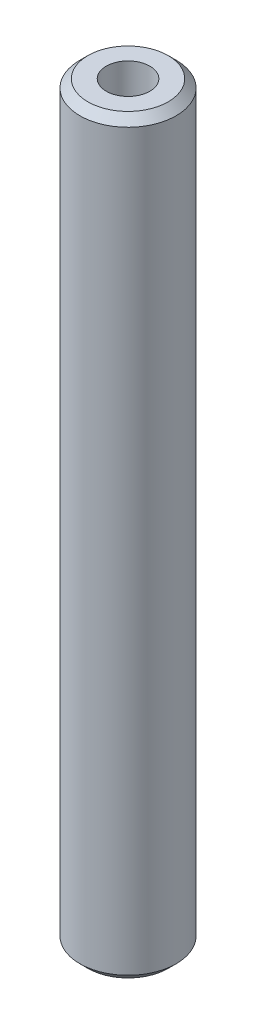
ISO-10303-21;
HEADER;
FILE_DESCRIPTION(('STEP AP214'),'2;1');
FILE_NAME('part.step','',(''),(''),'','','');
FILE_SCHEMA(('AUTOMOTIVE_DESIGN { 1 0 10303 214 1 1 1 1 }'));
ENDSEC;
DATA;
#1=APPLICATION_CONTEXT('core data for automotive mechanical design processes');
#2=APPLICATION_PROTOCOL_DEFINITION('international standard','automotive_design',2000,#1);
#3=PRODUCT_CONTEXT('',#1,'mechanical');
#4=PRODUCT('Part','Part','',(#3));
#5=PRODUCT_RELATED_PRODUCT_CATEGORY('part','',(#4));
#6=PRODUCT_DEFINITION_FORMATION('','',#4);
#7=PRODUCT_DEFINITION_CONTEXT('part definition',#1,'design');
#8=PRODUCT_DEFINITION('design','',#6,#7);
#9=PRODUCT_DEFINITION_SHAPE('','',#8);
#10=(LENGTH_UNIT() NAMED_UNIT(*) SI_UNIT(.MILLI.,.METRE.));
#11=(NAMED_UNIT(*) PLANE_ANGLE_UNIT() SI_UNIT($,.RADIAN.));
#12=(NAMED_UNIT(*) SI_UNIT($,.STERADIAN.) SOLID_ANGLE_UNIT());
#13=UNCERTAINTY_MEASURE_WITH_UNIT(LENGTH_MEASURE(1.E-05),#10,'distance_accuracy_value','');
#14=(GEOMETRIC_REPRESENTATION_CONTEXT(3) GLOBAL_UNCERTAINTY_ASSIGNED_CONTEXT((#13)) GLOBAL_UNIT_ASSIGNED_CONTEXT((#10,
#11,#12)) REPRESENTATION_CONTEXT('',''));
#15=CARTESIAN_POINT('',(0.,0.,0.));
#16=DIRECTION('',(0.,0.,1.));
#17=DIRECTION('',(1.,0.,0.));
#18=AXIS2_PLACEMENT_3D('',#15,#16,#17);
#19=CARTESIAN_POINT('',(0.,428.601661325985,0.));
#20=DIRECTION('',(0.,-1.,0.));
#21=DIRECTION('',(0.,0.,-1.));
#22=AXIS2_PLACEMENT_3D('',#19,#20,#21);
#23=CYLINDRICAL_SURFACE('',#22,27.5);
#24=CARTESIAN_POINT('',(0.,424.009006591973,0.));
#25=DIRECTION('',(0.,1.,0.));
#26=DIRECTION('',(0.,0.,1.));
#27=AXIS2_PLACEMENT_3D('',#24,#25,#26);
#28=CIRCLE('',#27,27.5);
#29=CARTESIAN_POINT('',(0.,424.009006591973,-27.5));
#30=VERTEX_POINT('',#29);
#31=EDGE_CURVE('E50',#30,#30,#28,.F.);
#32=CARTESIAN_POINT('',(0.,4.59265473401199,0.));
#33=DIRECTION('',(0.,1.,0.));
#34=DIRECTION('',(0.,0.,1.));
#35=AXIS2_PLACEMENT_3D('',#32,#33,#34);
#36=CIRCLE('',#35,27.5);
#37=CARTESIAN_POINT('',(0.,4.59265473401194,-27.5));
#38=VERTEX_POINT('',#37);
#39=EDGE_CURVE('E51',#38,#38,#36,.T.);
#40=CARTESIAN_POINT('',(0.,424.009006591973,-27.5));
#41=CARTESIAN_POINT('',(0.,419.64008626012,-27.5));
#42=CARTESIAN_POINT('',(0.,415.271165928266,-27.5));
#43=CARTESIAN_POINT('',(0.,406.533325264558,-27.5));
#44=CARTESIAN_POINT('',(0.,402.164404932705,-27.5));
#45=CARTESIAN_POINT('',(0.,393.426564268997,-27.5));
#46=CARTESIAN_POINT('',(0.,389.057643937143,-27.5));
#47=CARTESIAN_POINT('',(0.,380.319803273436,-27.5));
#48=CARTESIAN_POINT('',(0.,375.950882941582,-27.5));
#49=CARTESIAN_POINT('',(0.,367.213042277874,-27.5));
#50=CARTESIAN_POINT('',(0.,362.844121946021,-27.5));
#51=CARTESIAN_POINT('',(0.,354.106281282313,-27.5));
#52=CARTESIAN_POINT('',(0.,349.737360950459,-27.5));
#53=CARTESIAN_POINT('',(0.,340.999520286752,-27.5));
#54=CARTESIAN_POINT('',(0.,336.630599954898,-27.5));
#55=CARTESIAN_POINT('',(0.,327.892759291191,-27.5));
#56=CARTESIAN_POINT('',(0.,323.523838959337,-27.5));
#57=CARTESIAN_POINT('',(0.,314.785998295629,-27.5));
#58=CARTESIAN_POINT('',(0.,310.417077963776,-27.5));
#59=CARTESIAN_POINT('',(0.,301.679237300068,-27.5));
#60=CARTESIAN_POINT('',(0.,297.310316968214,-27.5));
#61=CARTESIAN_POINT('',(0.,288.572476304507,-27.5));
#62=CARTESIAN_POINT('',(0.,284.203555972653,-27.5));
#63=CARTESIAN_POINT('',(0.,275.465715308945,-27.5));
#64=CARTESIAN_POINT('',(0.,271.096794977092,-27.5));
#65=CARTESIAN_POINT('',(0.,262.358954313384,-27.5));
#66=CARTESIAN_POINT('',(0.,257.99003398153,-27.5));
#67=CARTESIAN_POINT('',(0.,249.252193317823,-27.5));
#68=CARTESIAN_POINT('',(0.,244.883272985969,-27.5));
#69=CARTESIAN_POINT('',(0.,236.145432322261,-27.5));
#70=CARTESIAN_POINT('',(0.,231.776511990408,-27.5));
#71=CARTESIAN_POINT('',(0.,223.0386713267,-27.5));
#72=CARTESIAN_POINT('',(0.,218.669750994846,-27.5));
#73=CARTESIAN_POINT('',(0.,209.931910331139,-27.5));
#74=CARTESIAN_POINT('',(0.,205.562989999285,-27.5));
#75=CARTESIAN_POINT('',(0.,196.825149335578,-27.5));
#76=CARTESIAN_POINT('',(0.,192.456229003724,-27.5));
#77=CARTESIAN_POINT('',(0.,183.718388340016,-27.5));
#78=CARTESIAN_POINT('',(0.,179.349468008163,-27.5));
#79=CARTESIAN_POINT('',(0.,170.611627344455,-27.5));
#80=CARTESIAN_POINT('',(0.,166.242707012601,-27.5));
#81=CARTESIAN_POINT('',(0.,157.504866348894,-27.5));
#82=CARTESIAN_POINT('',(0.,153.13594601704,-27.5));
#83=CARTESIAN_POINT('',(0.,144.398105353332,-27.5));
#84=CARTESIAN_POINT('',(0.,140.029185021479,-27.5));
#85=CARTESIAN_POINT('',(0.,131.291344357771,-27.5));
#86=CARTESIAN_POINT('',(0.,126.922424025917,-27.5));
#87=CARTESIAN_POINT('',(0.,118.18458336221,-27.5));
#88=CARTESIAN_POINT('',(0.,113.815663030356,-27.5));
#89=CARTESIAN_POINT('',(0.,105.077822366649,-27.5));
#90=CARTESIAN_POINT('',(0.,100.708902034795,-27.5));
#91=CARTESIAN_POINT('',(0.,91.9710613710872,-27.5));
#92=CARTESIAN_POINT('',(0.,87.6021410392335,-27.5));
#93=CARTESIAN_POINT('',(0.,78.8643003755259,-27.5));
#94=CARTESIAN_POINT('',(0.,74.4953800436722,-27.5));
#95=CARTESIAN_POINT('',(0.,65.7575393799646,-27.5));
#96=CARTESIAN_POINT('',(0.,61.3886190481109,-27.5));
#97=CARTESIAN_POINT('',(0.,52.6507783844034,-27.5));
#98=CARTESIAN_POINT('',(0.,48.2818580525496,-27.5));
#99=CARTESIAN_POINT('',(0.,39.5440173888421,-27.5));
#100=CARTESIAN_POINT('',(0.,35.1750970569883,-27.5));
#101=CARTESIAN_POINT('',(0.,26.4372563932808,-27.5));
#102=CARTESIAN_POINT('',(0.,22.068336061427,-27.5));
#103=CARTESIAN_POINT('',(0.,13.3304953977195,-27.5));
#104=CARTESIAN_POINT('',(0.,8.9615750658657,-27.5));
#105=CARTESIAN_POINT('',(0.,4.59265473401194,-27.5));
#106=B_SPLINE_CURVE_WITH_KNOTS('',3,(#40,#41,#42,#43,#44,#45,#46,#47,#48,#49,#50,#51,#52,#53,
#54,#55,#56,#57,#58,#59,#60,#61,#62,#63,#64,#65,#66,#67,#68,#69,#70,#71,#72,#73,#74,#75,#76,#77,
#78,#79,#80,#81,#82,#83,#84,#85,#86,#87,#88,#89,#90,#91,#92,#93,#94,#95,#96,#97,#98,#99,#100,
#101,#102,#103,#104,#105),.UNSPECIFIED.,.F.,.F.,(4,2,2,2,2,2,2,2,2,2,2,2,2,2,2,2,2,2,2,2,2,2,2,
2,2,2,2,2,2,2,2,2,4),(0.,13.1067609955614,26.2135219911226,39.3202829866839,52.4270439822452,
65.5338049778065,78.6405659733678,91.7473269689291,104.85408796449,117.960848960052,
131.067609955613,144.174370951174,157.281131946736,170.387892942297,183.494653937858,
196.601414933419,209.708175928981,222.814936924542,235.921697920103,249.028458915665,
262.135219911226,275.241980906787,288.348741902349,301.45550289791,314.562263893471,
327.669024889032,340.775785884594,353.882546880155,366.989307875716,380.096068871278,
393.202829866839,406.3095908624,419.416351857962),.UNSPECIFIED.);
#107=EDGE_CURVE('BSEAM39',#30,#38,#106,.T.);
#108=ORIENTED_EDGE('',*,*,#31,.T.);
#109=ORIENTED_EDGE('',*,*,#39,.T.);
#110=ORIENTED_EDGE('',*,*,#107,.T.);
#111=ORIENTED_EDGE('',*,*,#107,.F.);
#112=EDGE_LOOP('',(#108,#110,#109,#111));
#113=FACE_BOUND('',#112,.T.);
#114=ADVANCED_FACE('F39',(#113),#23,.T.);
#115=CARTESIAN_POINT('',(0.,428.601661325985,0.));
#116=DIRECTION('',(0.,1.,0.));
#117=DIRECTION('',(0.,0.,1.));
#118=AXIS2_PLACEMENT_3D('',#115,#116,#117);
#119=PLANE('',#118);
#120=CARTESIAN_POINT('',(0.,428.601661325985,0.));
#121=DIRECTION('',(0.,1.,0.));
#122=DIRECTION('',(0.,0.,1.));
#123=AXIS2_PLACEMENT_3D('',#120,#121,#122);
#124=CIRCLE('',#123,22.9073452659884);
#125=CARTESIAN_POINT('',(0.,428.601661325985,22.9073452659884));
#126=VERTEX_POINT('',#125);
#127=EDGE_CURVE('E54',#126,#126,#124,.T.);
#128=ORIENTED_EDGE('',*,*,#127,.T.);
#129=EDGE_LOOP('',(#128));
#130=FACE_BOUND('',#129,.T.);
#131=CARTESIAN_POINT('',(0.,428.601661325985,0.));
#132=DIRECTION('',(0.,1.,0.));
#133=DIRECTION('',(0.,0.,1.));
#134=AXIS2_PLACEMENT_3D('',#131,#132,#133);
#135=CIRCLE('',#134,12.4533792434952);
#136=CARTESIAN_POINT('',(0.,428.601661325985,-12.4533792434952));
#137=VERTEX_POINT('',#136);
#138=EDGE_CURVE('E58',#137,#137,#135,.T.);
#139=ORIENTED_EDGE('',*,*,#138,.F.);
#140=EDGE_LOOP('',(#139));
#141=FACE_BOUND('',#140,.T.);
#142=ADVANCED_FACE('F69',(#130,#141),#119,.T.);
#143=CARTESIAN_POINT('',(0.,0.,0.));
#144=DIRECTION('',(0.,1.,0.));
#145=DIRECTION('',(0.,0.,1.));
#146=AXIS2_PLACEMENT_3D('',#143,#144,#145);
#147=PLANE('',#146);
#148=CARTESIAN_POINT('',(0.,0.,0.));
#149=DIRECTION('',(0.,1.,0.));
#150=DIRECTION('',(0.,0.,1.));
#151=AXIS2_PLACEMENT_3D('',#148,#149,#150);
#152=CIRCLE('',#151,22.907345265988);
#153=CARTESIAN_POINT('',(0.,0.,22.907345265988));
#154=VERTEX_POINT('',#153);
#155=EDGE_CURVE('E10',#154,#154,#152,.F.);
#156=ORIENTED_EDGE('',*,*,#155,.T.);
#157=EDGE_LOOP('',(#156));
#158=FACE_BOUND('',#157,.T.);
#159=CARTESIAN_POINT('',(0.,0.,0.));
#160=DIRECTION('',(0.,1.,0.));
#161=DIRECTION('',(0.,0.,1.));
#162=AXIS2_PLACEMENT_3D('',#159,#160,#161);
#163=CIRCLE('',#162,12.4533792434952);
#164=CARTESIAN_POINT('',(0.,0.,-12.4533792434952));
#165=VERTEX_POINT('',#164);
#166=EDGE_CURVE('E63',#165,#165,#163,.T.);
#167=ORIENTED_EDGE('',*,*,#166,.T.);
#168=EDGE_LOOP('',(#167));
#169=FACE_BOUND('',#168,.T.);
#170=ADVANCED_FACE('F75',(#158,#169),#147,.F.);
#171=CARTESIAN_POINT('',(0.,428.601661325985,0.));
#172=DIRECTION('',(0.,-1.,0.));
#173=DIRECTION('',(0.,0.,-1.));
#174=AXIS2_PLACEMENT_3D('',#171,#172,#173);
#175=CYLINDRICAL_SURFACE('',#174,12.4533792434952);
#176=CARTESIAN_POINT('',(0.,428.601661325985,-12.4533792434952));
#177=CARTESIAN_POINT('',(0.,424.137060687173,-12.4533792434952));
#178=CARTESIAN_POINT('',(0.,419.67246004836,-12.4533792434952));
#179=CARTESIAN_POINT('',(0.,410.743258770736,-12.4533792434952));
#180=CARTESIAN_POINT('',(0.,406.278658131923,-12.4533792434952));
#181=CARTESIAN_POINT('',(0.,397.349456854299,-12.4533792434952));
#182=CARTESIAN_POINT('',(0.,392.884856215486,-12.4533792434952));
#183=CARTESIAN_POINT('',(0.,383.955654937862,-12.4533792434952));
#184=CARTESIAN_POINT('',(0.,379.491054299049,-12.4533792434952));
#185=CARTESIAN_POINT('',(0.,370.561853021425,-12.4533792434952));
#186=CARTESIAN_POINT('',(0.,366.097252382612,-12.4533792434952));
#187=CARTESIAN_POINT('',(0.,357.168051104988,-12.4533792434952));
#188=CARTESIAN_POINT('',(0.,352.703450466175,-12.4533792434952));
#189=CARTESIAN_POINT('',(0.,343.77424918855,-12.4533792434952));
#190=CARTESIAN_POINT('',(0.,339.309648549738,-12.4533792434952));
#191=CARTESIAN_POINT('',(0.,330.380447272113,-12.4533792434952));
#192=CARTESIAN_POINT('',(0.,325.915846633301,-12.4533792434952));
#193=CARTESIAN_POINT('',(0.,316.986645355676,-12.4533792434952));
#194=CARTESIAN_POINT('',(0.,312.522044716864,-12.4533792434952));
#195=CARTESIAN_POINT('',(0.,303.592843439239,-12.4533792434952));
#196=CARTESIAN_POINT('',(0.,299.128242800427,-12.4533792434952));
#197=CARTESIAN_POINT('',(0.,290.199041522802,-12.4533792434952));
#198=CARTESIAN_POINT('',(0.,285.73444088399,-12.4533792434952));
#199=CARTESIAN_POINT('',(0.,276.805239606365,-12.4533792434952));
#200=CARTESIAN_POINT('',(0.,272.340638967553,-12.4533792434952));
#201=CARTESIAN_POINT('',(0.,263.411437689928,-12.4533792434952));
#202=CARTESIAN_POINT('',(0.,258.946837051116,-12.4533792434952));
#203=CARTESIAN_POINT('',(0.,250.017635773491,-12.4533792434952));
#204=CARTESIAN_POINT('',(0.,245.553035134679,-12.4533792434952));
#205=CARTESIAN_POINT('',(0.,236.623833857054,-12.4533792434952));
#206=CARTESIAN_POINT('',(0.,232.159233218242,-12.4533792434952));
#207=CARTESIAN_POINT('',(0.,223.230031940617,-12.4533792434952));
#208=CARTESIAN_POINT('',(0.,218.765431301805,-12.4533792434952));
#209=CARTESIAN_POINT('',(0.,209.83623002418,-12.4533792434952));
#210=CARTESIAN_POINT('',(0.,205.371629385368,-12.4533792434952));
#211=CARTESIAN_POINT('',(0.,196.442428107743,-12.4533792434952));
#212=CARTESIAN_POINT('',(0.,191.977827468931,-12.4533792434952));
#213=CARTESIAN_POINT('',(0.,183.048626191306,-12.4533792434952));
#214=CARTESIAN_POINT('',(0.,178.584025552494,-12.4533792434952));
#215=CARTESIAN_POINT('',(0.,169.654824274869,-12.4533792434952));
#216=CARTESIAN_POINT('',(0.,165.190223636057,-12.4533792434952));
#217=CARTESIAN_POINT('',(0.,156.261022358432,-12.4533792434952));
#218=CARTESIAN_POINT('',(0.,151.79642171962,-12.4533792434952));
#219=CARTESIAN_POINT('',(0.,142.867220441995,-12.4533792434952));
#220=CARTESIAN_POINT('',(0.,138.402619803183,-12.4533792434952));
#221=CARTESIAN_POINT('',(0.,129.473418525558,-12.4533792434952));
#222=CARTESIAN_POINT('',(0.,125.008817886746,-12.4533792434952));
#223=CARTESIAN_POINT('',(0.,116.079616609121,-12.4533792434952));
#224=CARTESIAN_POINT('',(0.,111.615015970309,-12.4533792434952));
#225=CARTESIAN_POINT('',(0.,102.685814692684,-12.4533792434952));
#226=CARTESIAN_POINT('',(0.,98.2212140538716,-12.4533792434952));
#227=CARTESIAN_POINT('',(0.,89.2920127762469,-12.4533792434952));
#228=CARTESIAN_POINT('',(0.,84.8274121374345,-12.4533792434952));
#229=CARTESIAN_POINT('',(0.,75.8982108598098,-12.4533792434952));
#230=CARTESIAN_POINT('',(0.,71.4336102209975,-12.4533792434952));
#231=CARTESIAN_POINT('',(0.,62.5044089433728,-12.4533792434952));
#232=CARTESIAN_POINT('',(0.,58.0398083045605,-12.4533792434952));
#233=CARTESIAN_POINT('',(0.,49.1106070269358,-12.4533792434952));
#234=CARTESIAN_POINT('',(0.,44.6460063881235,-12.4533792434952));
#235=CARTESIAN_POINT('',(0.,35.7168051104988,-12.4533792434952));
#236=CARTESIAN_POINT('',(0.,31.2522044716864,-12.4533792434952));
#237=CARTESIAN_POINT('',(0.,22.3230031940617,-12.4533792434952));
#238=CARTESIAN_POINT('',(0.,17.8584025552494,-12.4533792434952));
#239=CARTESIAN_POINT('',(0.,8.92920127762468,-12.4533792434952));
#240=CARTESIAN_POINT('',(0.,4.46460063881234,-12.4533792434952));
#241=CARTESIAN_POINT('',(0.,0.,-12.4533792434952));
#242=B_SPLINE_CURVE_WITH_KNOTS('',3,(#176,#177,#178,#179,#180,#181,#182,#183,#184,#185,#186,
#187,#188,#189,#190,#191,#192,#193,#194,#195,#196,#197,#198,#199,#200,#201,#202,#203,#204,#205,
#206,#207,#208,#209,#210,#211,#212,#213,#214,#215,#216,#217,#218,#219,#220,#221,#222,#223,#224,
#225,#226,#227,#228,#229,#230,#231,#232,#233,#234,#235,#236,#237,#238,#239,#240,#241),
.UNSPECIFIED.,.F.,.F.,(4,2,2,2,2,2,2,2,2,2,2,2,2,2,2,2,2,2,2,2,2,2,2,2,2,2,2,2,2,2,2,2,4),(0.,
13.393801916437,26.787603832874,40.1814057493111,53.5752076657481,66.9690095821851,
80.3628114986221,93.7566134150592,107.150415331496,120.544217247933,133.93801916437,
147.331821080807,160.725622997244,174.119424913681,187.513226830118,200.907028746555,
214.300830662992,227.694632579429,241.088434495867,254.482236412304,267.876038328741,
281.269840245178,294.663642161615,308.057444078052,321.451245994489,334.845047910926,
348.238849827363,361.6326517438,375.026453660237,388.420255576674,401.814057493111,
415.207859409548,428.601661325985),.UNSPECIFIED.);
#243=EDGE_CURVE('BSEAM70',#137,#165,#242,.T.);
#244=ORIENTED_EDGE('',*,*,#138,.T.);
#245=ORIENTED_EDGE('',*,*,#166,.F.);
#246=ORIENTED_EDGE('',*,*,#243,.T.);
#247=ORIENTED_EDGE('',*,*,#243,.F.);
#248=EDGE_LOOP('',(#244,#246,#245,#247));
#249=FACE_BOUND('',#248,.T.);
#250=ADVANCED_FACE('F70',(#249),#175,.F.);
#251=CARTESIAN_POINT('',(0.,428.601661325985,0.));
#252=DIRECTION('',(0.,-1.,0.));
#253=DIRECTION('',(0.,0.,-1.));
#254=AXIS2_PLACEMENT_3D('',#251,#252,#253);
#255=CONICAL_SURFACE('',#254,22.9073452659884,0.785398163397452);
#256=ORIENTED_EDGE('',*,*,#31,.F.);
#257=EDGE_LOOP('',(#256));
#258=FACE_BOUND('',#257,.T.);
#259=ORIENTED_EDGE('',*,*,#127,.F.);
#260=EDGE_LOOP('',(#259));
#261=FACE_BOUND('',#260,.T.);
#262=ADVANCED_FACE('F81',(#258,#261),#255,.T.);
#263=CARTESIAN_POINT('',(0.,4.59265473401199,0.));
#264=DIRECTION('',(0.,1.,0.));
#265=DIRECTION('',(0.,0.,1.));
#266=AXIS2_PLACEMENT_3D('',#263,#264,#265);
#267=CONICAL_SURFACE('',#266,27.5,0.785398163397453);
#268=ORIENTED_EDGE('',*,*,#155,.F.);
#269=EDGE_LOOP('',(#268));
#270=FACE_BOUND('',#269,.T.);
#271=ORIENTED_EDGE('',*,*,#39,.F.);
#272=EDGE_LOOP('',(#271));
#273=FACE_BOUND('',#272,.T.);
#274=ADVANCED_FACE('F45',(#270,#273),#267,.T.);
#275=CLOSED_SHELL('',(#114,#142,#170,#250,#262,#274));
#276=MANIFOLD_SOLID_BREP('B2',#275);
#277=ADVANCED_BREP_SHAPE_REPRESENTATION('',(#18,#276),#14);
#278=SHAPE_DEFINITION_REPRESENTATION(#9,#277);
ENDSEC;
END-ISO-10303-21;
